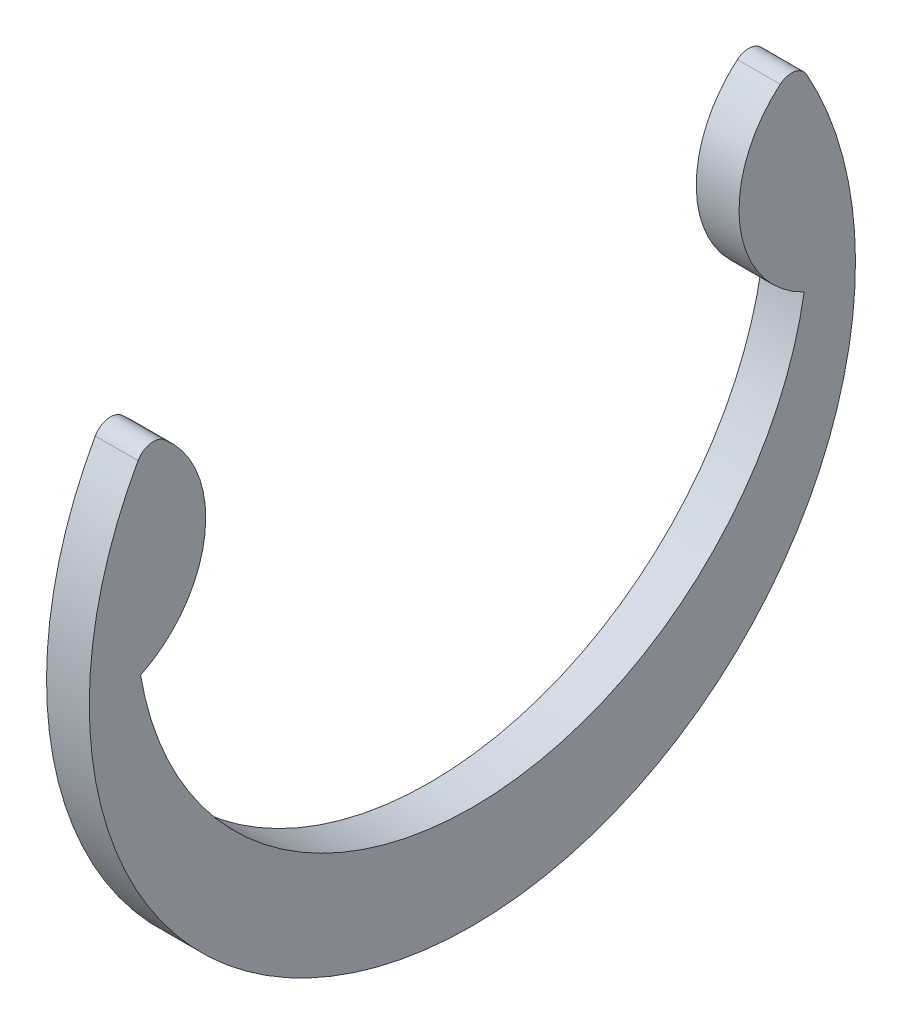
ISO-10303-21;
HEADER;
FILE_DESCRIPTION(('STEP AP214'),'2;1');
FILE_NAME('part.step','',(''),(''),'','','');
FILE_SCHEMA(('AUTOMOTIVE_DESIGN { 1 0 10303 214 1 1 1 1 }'));
ENDSEC;
DATA;
#1=APPLICATION_CONTEXT('core data for automotive mechanical design processes');
#2=APPLICATION_PROTOCOL_DEFINITION('international standard','automotive_design',2000,#1);
#3=PRODUCT_CONTEXT('',#1,'mechanical');
#4=PRODUCT('Part','Part','',(#3));
#5=PRODUCT_RELATED_PRODUCT_CATEGORY('part','',(#4));
#6=PRODUCT_DEFINITION_FORMATION('','',#4);
#7=PRODUCT_DEFINITION_CONTEXT('part definition',#1,'design');
#8=PRODUCT_DEFINITION('design','',#6,#7);
#9=PRODUCT_DEFINITION_SHAPE('','',#8);
#10=(LENGTH_UNIT() NAMED_UNIT(*) SI_UNIT(.MILLI.,.METRE.));
#11=(NAMED_UNIT(*) PLANE_ANGLE_UNIT() SI_UNIT($,.RADIAN.));
#12=(NAMED_UNIT(*) SI_UNIT($,.STERADIAN.) SOLID_ANGLE_UNIT());
#13=UNCERTAINTY_MEASURE_WITH_UNIT(LENGTH_MEASURE(1.E-05),#10,'distance_accuracy_value','');
#14=(GEOMETRIC_REPRESENTATION_CONTEXT(3) GLOBAL_UNCERTAINTY_ASSIGNED_CONTEXT((#13)) GLOBAL_UNIT_ASSIGNED_CONTEXT((#10,
#11,#12)) REPRESENTATION_CONTEXT('',''));
#15=CARTESIAN_POINT('',(0.,0.,0.));
#16=DIRECTION('',(0.,0.,1.));
#17=DIRECTION('',(1.,0.,0.));
#18=AXIS2_PLACEMENT_3D('',#15,#16,#17);
#19=CARTESIAN_POINT('',(0.3175,1.53954533421681,5.66906241112479));
#20=DIRECTION('',(-1.,0.,0.));
#21=DIRECTION('',(0.,0.,1.));
#22=AXIS2_PLACEMENT_3D('',#19,#20,#21);
#23=CYLINDRICAL_SURFACE('',#22,1.7087909009647);
#24=CARTESIAN_POINT('',(-0.3175,1.53954533421681,5.66906241112479));
#25=DIRECTION('',(1.,0.,0.));
#26=DIRECTION('',(0.,0.,1.));
#27=AXIS2_PLACEMENT_3D('',#24,#25,#26);
#28=CIRCLE('',#27,1.7087909009647);
#29=CARTESIAN_POINT('',(-0.3175,0.,4.9276));
#30=VERTEX_POINT('',#29);
#31=CARTESIAN_POINT('',(-0.3175,2.84950455432869,4.57180529227634));
#32=VERTEX_POINT('',#31);
#33=EDGE_CURVE('E120',#30,#32,#28,.T.);
#34=ORIENTED_EDGE('',*,*,#33,.T.);
#35=DIRECTION('',(-1.,0.,0.));
#36=VECTOR('',#35,1.);
#37=CARTESIAN_POINT('',(0.3175,2.84950455432869,4.57180529227634));
#38=LINE('',#37,#36);
#39=CARTESIAN_POINT('',(0.3175,2.84950455432869,4.57180529227634));
#40=VERTEX_POINT('',#39);
#41=EDGE_CURVE('E11',#40,#32,#38,.T.);
#42=ORIENTED_EDGE('',*,*,#41,.F.);
#43=CARTESIAN_POINT('',(0.3175,1.53954533421681,5.66906241112479));
#44=DIRECTION('',(1.,0.,0.));
#45=DIRECTION('',(0.,0.,1.));
#46=AXIS2_PLACEMENT_3D('',#43,#44,#45);
#47=CIRCLE('',#46,1.7087909009647);
#48=CARTESIAN_POINT('',(0.3175,0.,4.9276));
#49=VERTEX_POINT('',#48);
#50=EDGE_CURVE('E130',#49,#40,#47,.T.);
#51=ORIENTED_EDGE('',*,*,#50,.F.);
#52=DIRECTION('',(-1.,0.,0.));
#53=VECTOR('',#52,1.);
#54=CARTESIAN_POINT('',(0.3175,0.,4.9276));
#55=LINE('',#54,#53);
#56=EDGE_CURVE('E116',#49,#30,#55,.T.);
#57=ORIENTED_EDGE('',*,*,#56,.T.);
#58=EDGE_LOOP('',(#34,#42,#51,#57));
#59=FACE_BOUND('',#58,.T.);
#60=ADVANCED_FACE('F36',(#59),#23,.T.);
#61=CARTESIAN_POINT('',(0.3175,2.65011523069168,4.73881915913886));
#62=DIRECTION('',(-1.,0.,0.));
#63=DIRECTION('',(0.,0.,1.));
#64=AXIS2_PLACEMENT_3D('',#61,#62,#63);
#65=CYLINDRICAL_SURFACE('',#64,0.260095624924362);
#66=CARTESIAN_POINT('',(-0.3175,2.65011523069168,4.73881915913886));
#67=DIRECTION('',(1.,0.,0.));
#68=DIRECTION('',(0.,0.,1.));
#69=AXIS2_PLACEMENT_3D('',#66,#67,#68);
#70=CIRCLE('',#69,0.260095624924362);
#71=CARTESIAN_POINT('',(-0.3175,2.77706666666667,4.96582811713101));
#72=VERTEX_POINT('',#71);
#73=EDGE_CURVE('E123',#32,#72,#70,.T.);
#74=ORIENTED_EDGE('',*,*,#73,.T.);
#75=DIRECTION('',(-1.,0.,0.));
#76=VECTOR('',#75,1.);
#77=CARTESIAN_POINT('',(0.3175,2.77706666666667,4.96582811713101));
#78=LINE('',#77,#76);
#79=CARTESIAN_POINT('',(0.3175,2.77706666666667,4.96582811713101));
#80=VERTEX_POINT('',#79);
#81=EDGE_CURVE('E44',#80,#72,#78,.T.);
#82=ORIENTED_EDGE('',*,*,#81,.F.);
#83=CARTESIAN_POINT('',(0.3175,2.65011523069168,4.73881915913886));
#84=DIRECTION('',(1.,0.,0.));
#85=DIRECTION('',(0.,0.,1.));
#86=AXIS2_PLACEMENT_3D('',#83,#84,#85);
#87=CIRCLE('',#86,0.260095624924362);
#88=EDGE_CURVE('E89',#40,#80,#87,.T.);
#89=ORIENTED_EDGE('',*,*,#88,.F.);
#90=ORIENTED_EDGE('',*,*,#41,.T.);
#91=EDGE_LOOP('',(#74,#82,#89,#90));
#92=FACE_BOUND('',#91,.T.);
#93=ADVANCED_FACE('F154',(#92),#65,.T.);
#94=CARTESIAN_POINT('',(0.3175,0.,0.));
#95=DIRECTION('',(-1.,0.,0.));
#96=DIRECTION('',(0.,0.,1.));
#97=AXIS2_PLACEMENT_3D('',#94,#95,#96);
#98=CYLINDRICAL_SURFACE('',#97,5.6896);
#99=CARTESIAN_POINT('',(-0.3175,0.,0.));
#100=DIRECTION('',(1.,0.,0.));
#101=DIRECTION('',(0.,0.,1.));
#102=AXIS2_PLACEMENT_3D('',#99,#100,#101);
#103=CIRCLE('',#102,5.6896);
#104=CARTESIAN_POINT('',(-0.3175,2.77706666666667,-4.96582811713101));
#105=VERTEX_POINT('',#104);
#106=EDGE_CURVE('E125',#72,#105,#103,.T.);
#107=ORIENTED_EDGE('',*,*,#106,.T.);
#108=DIRECTION('',(-1.,0.,0.));
#109=VECTOR('',#108,1.);
#110=CARTESIAN_POINT('',(0.3175,2.77706666666667,-4.96582811713101));
#111=LINE('',#110,#109);
#112=CARTESIAN_POINT('',(0.3175,2.77706666666667,-4.96582811713101));
#113=VERTEX_POINT('',#112);
#114=EDGE_CURVE('E111',#113,#105,#111,.T.);
#115=ORIENTED_EDGE('',*,*,#114,.F.);
#116=CARTESIAN_POINT('',(0.3175,0.,0.));
#117=DIRECTION('',(1.,0.,0.));
#118=DIRECTION('',(0.,0.,1.));
#119=AXIS2_PLACEMENT_3D('',#116,#117,#118);
#120=CIRCLE('',#119,5.6896);
#121=EDGE_CURVE('E102',#80,#113,#120,.T.);
#122=ORIENTED_EDGE('',*,*,#121,.F.);
#123=ORIENTED_EDGE('',*,*,#81,.T.);
#124=EDGE_LOOP('',(#107,#115,#122,#123));
#125=FACE_BOUND('',#124,.T.);
#126=ADVANCED_FACE('F136',(#125),#98,.T.);
#127=CARTESIAN_POINT('',(0.3175,2.65011523069168,-4.73881915913886));
#128=DIRECTION('',(-1.,0.,0.));
#129=DIRECTION('',(0.,0.,1.));
#130=AXIS2_PLACEMENT_3D('',#127,#128,#129);
#131=CYLINDRICAL_SURFACE('',#130,0.260095624924362);
#132=CARTESIAN_POINT('',(-0.3175,2.65011523069168,-4.73881915913886));
#133=DIRECTION('',(1.,0.,0.));
#134=DIRECTION('',(0.,0.,-1.));
#135=AXIS2_PLACEMENT_3D('',#132,#133,#134);
#136=CIRCLE('',#135,0.260095624924362);
#137=CARTESIAN_POINT('',(-0.3175,2.84950455432869,-4.57180529227634));
#138=VERTEX_POINT('',#137);
#139=EDGE_CURVE('E110',#105,#138,#136,.T.);
#140=ORIENTED_EDGE('',*,*,#139,.T.);
#141=DIRECTION('',(-1.,0.,0.));
#142=VECTOR('',#141,1.);
#143=CARTESIAN_POINT('',(0.3175,2.84950455432869,-4.57180529227634));
#144=LINE('',#143,#142);
#145=CARTESIAN_POINT('',(0.3175,2.84950455432869,-4.57180529227634));
#146=VERTEX_POINT('',#145);
#147=EDGE_CURVE('E107',#146,#138,#144,.T.);
#148=ORIENTED_EDGE('',*,*,#147,.F.);
#149=CARTESIAN_POINT('',(0.3175,2.65011523069168,-4.73881915913886));
#150=DIRECTION('',(1.,0.,0.));
#151=DIRECTION('',(0.,0.,-1.));
#152=AXIS2_PLACEMENT_3D('',#149,#150,#151);
#153=CIRCLE('',#152,0.260095624924362);
#154=EDGE_CURVE('E96',#113,#146,#153,.T.);
#155=ORIENTED_EDGE('',*,*,#154,.F.);
#156=ORIENTED_EDGE('',*,*,#114,.T.);
#157=EDGE_LOOP('',(#140,#148,#155,#156));
#158=FACE_BOUND('',#157,.T.);
#159=ADVANCED_FACE('F108',(#158),#131,.T.);
#160=CARTESIAN_POINT('',(0.3175,1.53954533421681,-5.66906241112479));
#161=DIRECTION('',(-1.,0.,0.));
#162=DIRECTION('',(0.,0.,1.));
#163=AXIS2_PLACEMENT_3D('',#160,#161,#162);
#164=CYLINDRICAL_SURFACE('',#163,1.7087909009647);
#165=CARTESIAN_POINT('',(-0.3175,1.53954533421681,-5.66906241112479));
#166=DIRECTION('',(1.,0.,0.));
#167=DIRECTION('',(0.,0.,1.));
#168=AXIS2_PLACEMENT_3D('',#165,#166,#167);
#169=CIRCLE('',#168,1.7087909009647);
#170=CARTESIAN_POINT('',(-0.3175,0.,-4.9276));
#171=VERTEX_POINT('',#170);
#172=EDGE_CURVE('E75',#138,#171,#169,.T.);
#173=ORIENTED_EDGE('',*,*,#172,.T.);
#174=DIRECTION('',(-1.,0.,0.));
#175=VECTOR('',#174,1.);
#176=CARTESIAN_POINT('',(0.3175,0.,-4.9276));
#177=LINE('',#176,#175);
#178=CARTESIAN_POINT('',(0.3175,0.,-4.9276));
#179=VERTEX_POINT('',#178);
#180=EDGE_CURVE('E112',#179,#171,#177,.T.);
#181=ORIENTED_EDGE('',*,*,#180,.F.);
#182=CARTESIAN_POINT('',(0.3175,1.53954533421681,-5.66906241112479));
#183=DIRECTION('',(1.,0.,0.));
#184=DIRECTION('',(0.,0.,1.));
#185=AXIS2_PLACEMENT_3D('',#182,#183,#184);
#186=CIRCLE('',#185,1.7087909009647);
#187=EDGE_CURVE('E100',#146,#179,#186,.T.);
#188=ORIENTED_EDGE('',*,*,#187,.F.);
#189=ORIENTED_EDGE('',*,*,#147,.T.);
#190=EDGE_LOOP('',(#173,#181,#188,#189));
#191=FACE_BOUND('',#190,.T.);
#192=ADVANCED_FACE('F114',(#191),#164,.T.);
#193=CARTESIAN_POINT('',(0.3175,0.831695121951219,0.));
#194=DIRECTION('',(-1.,0.,0.));
#195=DIRECTION('',(0.,0.,1.));
#196=AXIS2_PLACEMENT_3D('',#193,#194,#195);
#197=CYLINDRICAL_SURFACE('',#196,4.99729512195122);
#198=CARTESIAN_POINT('',(-0.3175,0.831695121951219,0.));
#199=DIRECTION('',(-1.,0.,0.));
#200=DIRECTION('',(0.,0.,-1.));
#201=AXIS2_PLACEMENT_3D('',#198,#199,#200);
#202=CIRCLE('',#201,4.99729512195122);
#203=EDGE_CURVE('E81',#171,#30,#202,.T.);
#204=ORIENTED_EDGE('',*,*,#203,.T.);
#205=ORIENTED_EDGE('',*,*,#56,.F.);
#206=CARTESIAN_POINT('',(0.3175,0.831695121951219,0.));
#207=DIRECTION('',(-1.,0.,0.));
#208=DIRECTION('',(0.,0.,-1.));
#209=AXIS2_PLACEMENT_3D('',#206,#207,#208);
#210=CIRCLE('',#209,4.99729512195122);
#211=EDGE_CURVE('E52',#179,#49,#210,.T.);
#212=ORIENTED_EDGE('',*,*,#211,.F.);
#213=ORIENTED_EDGE('',*,*,#180,.T.);
#214=EDGE_LOOP('',(#204,#205,#212,#213));
#215=FACE_BOUND('',#214,.T.);
#216=ADVANCED_FACE('F143',(#215),#197,.F.);
#217=CARTESIAN_POINT('',(0.3175,1.18562022808401,2.8345312055624));
#218=DIRECTION('',(-1.,0.,0.));
#219=DIRECTION('',(0.,0.,1.));
#220=AXIS2_PLACEMENT_3D('',#217,#218,#219);
#221=PLANE('',#220);
#222=ORIENTED_EDGE('',*,*,#50,.T.);
#223=ORIENTED_EDGE('',*,*,#88,.T.);
#224=ORIENTED_EDGE('',*,*,#121,.T.);
#225=ORIENTED_EDGE('',*,*,#154,.T.);
#226=ORIENTED_EDGE('',*,*,#187,.T.);
#227=ORIENTED_EDGE('',*,*,#211,.T.);
#228=EDGE_LOOP('',(#222,#223,#224,#225,#226,#227));
#229=FACE_BOUND('',#228,.T.);
#230=ADVANCED_FACE('F98',(#229),#221,.F.);
#231=CARTESIAN_POINT('',(-0.3175,1.18562022808401,2.8345312055624));
#232=DIRECTION('',(-1.,0.,0.));
#233=DIRECTION('',(0.,0.,1.));
#234=AXIS2_PLACEMENT_3D('',#231,#232,#233);
#235=PLANE('',#234);
#236=ORIENTED_EDGE('',*,*,#33,.F.);
#237=ORIENTED_EDGE('',*,*,#203,.F.);
#238=ORIENTED_EDGE('',*,*,#172,.F.);
#239=ORIENTED_EDGE('',*,*,#139,.F.);
#240=ORIENTED_EDGE('',*,*,#106,.F.);
#241=ORIENTED_EDGE('',*,*,#73,.F.);
#242=EDGE_LOOP('',(#236,#237,#238,#239,#240,#241));
#243=FACE_BOUND('',#242,.T.);
#244=ADVANCED_FACE('F139',(#243),#235,.T.);
#245=CLOSED_SHELL('',(#60,#93,#126,#159,#192,#216,#230,#244));
#246=MANIFOLD_SOLID_BREP('B2',#245);
#247=ADVANCED_BREP_SHAPE_REPRESENTATION('',(#18,#246),#14);
#248=SHAPE_DEFINITION_REPRESENTATION(#9,#247);
ENDSEC;
END-ISO-10303-21;
